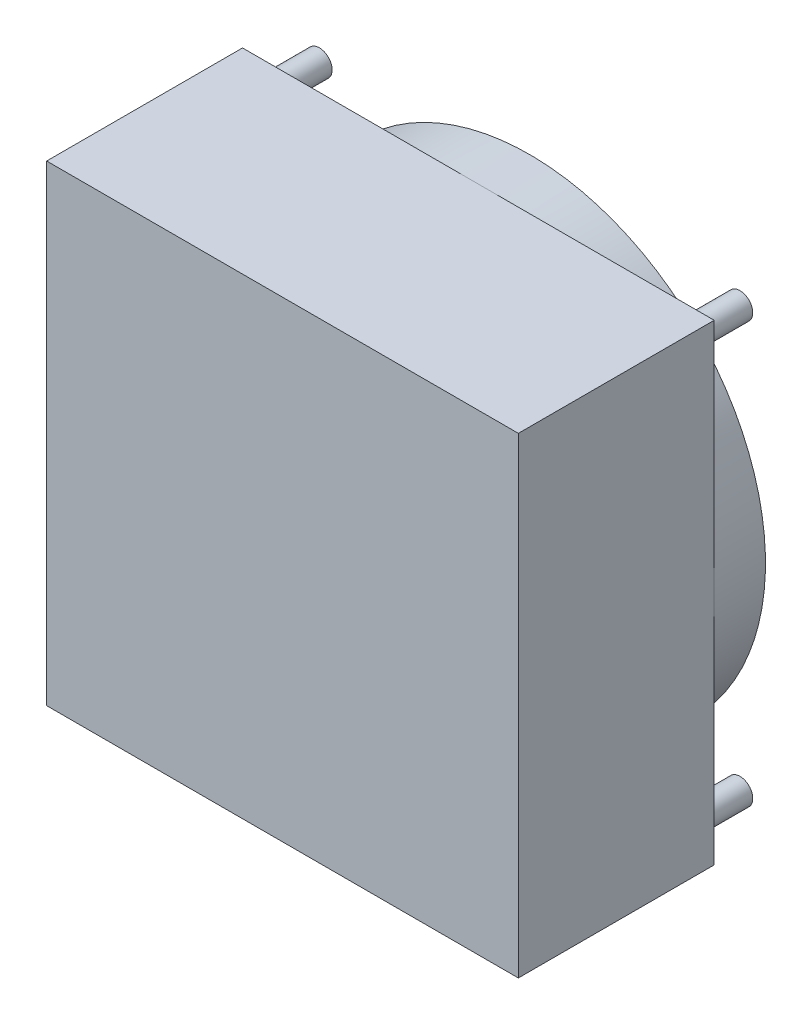
ISO-10303-21;
HEADER;
FILE_DESCRIPTION(('STEP AP214'),'2;1');
FILE_NAME('part.step','',(''),(''),'','','');
FILE_SCHEMA(('AUTOMOTIVE_DESIGN { 1 0 10303 214 1 1 1 1 }'));
ENDSEC;
DATA;
#1=APPLICATION_CONTEXT('core data for automotive mechanical design processes');
#2=APPLICATION_PROTOCOL_DEFINITION('international standard','automotive_design',2000,#1);
#3=PRODUCT_CONTEXT('',#1,'mechanical');
#4=PRODUCT('Part','Part','',(#3));
#5=PRODUCT_RELATED_PRODUCT_CATEGORY('part','',(#4));
#6=PRODUCT_DEFINITION_FORMATION('','',#4);
#7=PRODUCT_DEFINITION_CONTEXT('part definition',#1,'design');
#8=PRODUCT_DEFINITION('design','',#6,#7);
#9=PRODUCT_DEFINITION_SHAPE('','',#8);
#10=(LENGTH_UNIT() NAMED_UNIT(*) SI_UNIT(.MILLI.,.METRE.));
#11=(NAMED_UNIT(*) PLANE_ANGLE_UNIT() SI_UNIT($,.RADIAN.));
#12=(NAMED_UNIT(*) SI_UNIT($,.STERADIAN.) SOLID_ANGLE_UNIT());
#13=UNCERTAINTY_MEASURE_WITH_UNIT(LENGTH_MEASURE(1.E-05),#10,'distance_accuracy_value','');
#14=(GEOMETRIC_REPRESENTATION_CONTEXT(3) GLOBAL_UNCERTAINTY_ASSIGNED_CONTEXT((#13)) GLOBAL_UNIT_ASSIGNED_CONTEXT((#10,
#11,#12)) REPRESENTATION_CONTEXT('',''));
#15=CARTESIAN_POINT('',(0.,0.,0.));
#16=DIRECTION('',(0.,0.,1.));
#17=DIRECTION('',(1.,0.,0.));
#18=AXIS2_PLACEMENT_3D('',#15,#16,#17);
#19=CARTESIAN_POINT('',(0.,92.,0.));
#20=DIRECTION('',(0.,0.,-1.));
#21=DIRECTION('',(-1.,0.,0.));
#22=AXIS2_PLACEMENT_3D('',#19,#20,#21);
#23=PLANE('',#22);
#24=CARTESIAN_POINT('',(4.98,4.98,0.));
#25=DIRECTION('',(0.,0.,-1.));
#26=DIRECTION('',(-1.,0.,0.));
#27=AXIS2_PLACEMENT_3D('',#24,#25,#26);
#28=CIRCLE('',#27,2.5);
#29=CARTESIAN_POINT('',(2.48,4.98,0.));
#30=VERTEX_POINT('',#29);
#31=EDGE_CURVE('E145',#30,#30,#28,.T.);
#32=ORIENTED_EDGE('',*,*,#31,.F.);
#33=EDGE_LOOP('',(#32));
#34=FACE_BOUND('',#33,.T.);
#35=DIRECTION('',(0.,-1.,0.));
#36=VECTOR('',#35,1.);
#37=CARTESIAN_POINT('',(0.,0.,0.));
#38=LINE('',#37,#36);
#39=CARTESIAN_POINT('',(0.,46.,0.));
#40=VERTEX_POINT('',#39);
#41=CARTESIAN_POINT('',(0.,0.,0.));
#42=VERTEX_POINT('',#41);
#43=EDGE_CURVE('E141',#40,#42,#38,.T.);
#44=ORIENTED_EDGE('',*,*,#43,.F.);
#45=CARTESIAN_POINT('',(46.,46.,0.));
#46=DIRECTION('',(0.,0.,-1.));
#47=DIRECTION('',(-1.,0.,0.));
#48=AXIS2_PLACEMENT_3D('',#45,#46,#47);
#49=CIRCLE('',#48,46.);
#50=CARTESIAN_POINT('',(46.,0.,0.));
#51=VERTEX_POINT('',#50);
#52=EDGE_CURVE('E48',#51,#40,#49,.T.);
#53=ORIENTED_EDGE('',*,*,#52,.F.);
#54=DIRECTION('',(1.,0.,0.));
#55=VECTOR('',#54,1.);
#56=CARTESIAN_POINT('',(0.,0.,0.));
#57=LINE('',#56,#55);
#58=EDGE_CURVE('E137',#42,#51,#57,.T.);
#59=ORIENTED_EDGE('',*,*,#58,.F.);
#60=EDGE_LOOP('',(#44,#53,#59));
#61=FACE_BOUND('',#60,.T.);
#62=ADVANCED_FACE('F33',(#34,#61),#23,.T.);
#63=CARTESIAN_POINT('',(87.0200000000002,4.98000000000015,0.));
#64=DIRECTION('',(0.,0.,-1.));
#65=DIRECTION('',(-1.,0.,0.));
#66=AXIS2_PLACEMENT_3D('',#63,#64,#65);
#67=CIRCLE('',#66,2.5);
#68=CARTESIAN_POINT('',(84.5200000000002,4.98000000000015,0.));
#69=VERTEX_POINT('',#68);
#70=EDGE_CURVE('E152',#69,#69,#67,.T.);
#71=ORIENTED_EDGE('',*,*,#70,.F.);
#72=EDGE_LOOP('',(#71));
#73=FACE_BOUND('',#72,.T.);
#74=CARTESIAN_POINT('',(92.,0.,0.));
#75=VERTEX_POINT('',#74);
#76=EDGE_CURVE('E135',#51,#75,#57,.T.);
#77=ORIENTED_EDGE('',*,*,#76,.F.);
#78=CARTESIAN_POINT('',(92.,46.,0.));
#79=VERTEX_POINT('',#78);
#80=EDGE_CURVE('E109',#79,#51,#49,.T.);
#81=ORIENTED_EDGE('',*,*,#80,.F.);
#82=DIRECTION('',(0.,1.,0.));
#83=VECTOR('',#82,1.);
#84=CARTESIAN_POINT('',(92.,0.,0.));
#85=LINE('',#84,#83);
#86=EDGE_CURVE('E113',#75,#79,#85,.T.);
#87=ORIENTED_EDGE('',*,*,#86,.F.);
#88=EDGE_LOOP('',(#77,#81,#87));
#89=FACE_BOUND('',#88,.T.);
#90=ADVANCED_FACE('F134',(#73,#89),#23,.T.);
#91=CARTESIAN_POINT('',(87.0199999999997,87.0200000000003,0.));
#92=DIRECTION('',(0.,0.,-1.));
#93=DIRECTION('',(-1.,0.,0.));
#94=AXIS2_PLACEMENT_3D('',#91,#92,#93);
#95=CIRCLE('',#94,2.5);
#96=CARTESIAN_POINT('',(84.5199999999997,87.0200000000003,0.));
#97=VERTEX_POINT('',#96);
#98=EDGE_CURVE('E158',#97,#97,#95,.T.);
#99=ORIENTED_EDGE('',*,*,#98,.F.);
#100=EDGE_LOOP('',(#99));
#101=FACE_BOUND('',#100,.T.);
#102=CARTESIAN_POINT('',(92.,92.,0.));
#103=VERTEX_POINT('',#102);
#104=EDGE_CURVE('E107',#79,#103,#85,.T.);
#105=ORIENTED_EDGE('',*,*,#104,.F.);
#106=CARTESIAN_POINT('',(46.,92.,0.));
#107=VERTEX_POINT('',#106);
#108=EDGE_CURVE('E95',#107,#79,#49,.T.);
#109=ORIENTED_EDGE('',*,*,#108,.F.);
#110=DIRECTION('',(-1.,0.,0.));
#111=VECTOR('',#110,1.);
#112=CARTESIAN_POINT('',(0.,92.,0.));
#113=LINE('',#112,#111);
#114=EDGE_CURVE('E106',#103,#107,#113,.T.);
#115=ORIENTED_EDGE('',*,*,#114,.F.);
#116=EDGE_LOOP('',(#105,#109,#115));
#117=FACE_BOUND('',#116,.T.);
#118=ADVANCED_FACE('F105',(#101,#117),#23,.T.);
#119=CARTESIAN_POINT('',(4.97999999999957,87.0199999999996,0.));
#120=DIRECTION('',(0.,0.,-1.));
#121=DIRECTION('',(-1.,0.,0.));
#122=AXIS2_PLACEMENT_3D('',#119,#120,#121);
#123=CIRCLE('',#122,2.5);
#124=CARTESIAN_POINT('',(2.47999999999956,87.0199999999996,0.));
#125=VERTEX_POINT('',#124);
#126=EDGE_CURVE('E164',#125,#125,#123,.T.);
#127=ORIENTED_EDGE('',*,*,#126,.F.);
#128=EDGE_LOOP('',(#127));
#129=FACE_BOUND('',#128,.T.);
#130=CARTESIAN_POINT('',(0.,92.,0.));
#131=VERTEX_POINT('',#130);
#132=EDGE_CURVE('E78',#107,#131,#113,.T.);
#133=ORIENTED_EDGE('',*,*,#132,.F.);
#134=EDGE_CURVE('E92',#40,#107,#49,.T.);
#135=ORIENTED_EDGE('',*,*,#134,.F.);
#136=EDGE_CURVE('E112',#131,#40,#38,.T.);
#137=ORIENTED_EDGE('',*,*,#136,.F.);
#138=EDGE_LOOP('',(#133,#135,#137));
#139=FACE_BOUND('',#138,.T.);
#140=ADVANCED_FACE('F110',(#129,#139),#23,.T.);
#141=CARTESIAN_POINT('',(0.,0.,38.2));
#142=DIRECTION('',(1.,0.,0.));
#143=DIRECTION('',(0.,0.,-1.));
#144=AXIS2_PLACEMENT_3D('',#141,#142,#143);
#145=PLANE('',#144);
#146=ORIENTED_EDGE('',*,*,#136,.T.);
#147=ORIENTED_EDGE('',*,*,#43,.T.);
#148=DIRECTION('',(0.,0.,-1.));
#149=VECTOR('',#148,1.);
#150=CARTESIAN_POINT('',(0.,0.,38.2));
#151=LINE('',#150,#149);
#152=CARTESIAN_POINT('',(0.,0.,38.2));
#153=VERTEX_POINT('',#152);
#154=EDGE_CURVE('E11',#153,#42,#151,.T.);
#155=ORIENTED_EDGE('',*,*,#154,.F.);
#156=DIRECTION('',(0.,-1.,0.));
#157=VECTOR('',#156,1.);
#158=CARTESIAN_POINT('',(0.,0.,38.2));
#159=LINE('',#158,#157);
#160=CARTESIAN_POINT('',(0.,92.,38.2));
#161=VERTEX_POINT('',#160);
#162=EDGE_CURVE('E119',#161,#153,#159,.T.);
#163=ORIENTED_EDGE('',*,*,#162,.F.);
#164=DIRECTION('',(0.,0.,-1.));
#165=VECTOR('',#164,1.);
#166=CARTESIAN_POINT('',(0.,92.,38.2));
#167=LINE('',#166,#165);
#168=EDGE_CURVE('E124',#161,#131,#167,.T.);
#169=ORIENTED_EDGE('',*,*,#168,.T.);
#170=EDGE_LOOP('',(#146,#147,#155,#163,#169));
#171=FACE_BOUND('',#170,.T.);
#172=ADVANCED_FACE('F35',(#171),#145,.F.);
#173=CARTESIAN_POINT('',(0.,0.,38.2));
#174=DIRECTION('',(0.,1.,0.));
#175=DIRECTION('',(0.,0.,1.));
#176=AXIS2_PLACEMENT_3D('',#173,#174,#175);
#177=PLANE('',#176);
#178=ORIENTED_EDGE('',*,*,#58,.T.);
#179=ORIENTED_EDGE('',*,*,#76,.T.);
#180=DIRECTION('',(0.,0.,-1.));
#181=VECTOR('',#180,1.);
#182=CARTESIAN_POINT('',(92.,0.,38.2));
#183=LINE('',#182,#181);
#184=CARTESIAN_POINT('',(92.,0.,38.2));
#185=VERTEX_POINT('',#184);
#186=EDGE_CURVE('E41',#185,#75,#183,.T.);
#187=ORIENTED_EDGE('',*,*,#186,.F.);
#188=DIRECTION('',(1.,0.,0.));
#189=VECTOR('',#188,1.);
#190=CARTESIAN_POINT('',(0.,0.,38.2));
#191=LINE('',#190,#189);
#192=EDGE_CURVE('E85',#153,#185,#191,.T.);
#193=ORIENTED_EDGE('',*,*,#192,.F.);
#194=ORIENTED_EDGE('',*,*,#154,.T.);
#195=EDGE_LOOP('',(#178,#179,#187,#193,#194));
#196=FACE_BOUND('',#195,.T.);
#197=ADVANCED_FACE('F202',(#196),#177,.F.);
#198=CARTESIAN_POINT('',(92.,0.,38.2));
#199=DIRECTION('',(-1.,0.,0.));
#200=DIRECTION('',(0.,0.,1.));
#201=AXIS2_PLACEMENT_3D('',#198,#199,#200);
#202=PLANE('',#201);
#203=ORIENTED_EDGE('',*,*,#86,.T.);
#204=ORIENTED_EDGE('',*,*,#104,.T.);
#205=DIRECTION('',(0.,0.,-1.));
#206=VECTOR('',#205,1.);
#207=CARTESIAN_POINT('',(92.,92.,38.2));
#208=LINE('',#207,#206);
#209=CARTESIAN_POINT('',(92.,92.,38.2));
#210=VERTEX_POINT('',#209);
#211=EDGE_CURVE('E118',#210,#103,#208,.T.);
#212=ORIENTED_EDGE('',*,*,#211,.F.);
#213=DIRECTION('',(0.,1.,0.));
#214=VECTOR('',#213,1.);
#215=CARTESIAN_POINT('',(92.,0.,38.2));
#216=LINE('',#215,#214);
#217=EDGE_CURVE('E131',#185,#210,#216,.T.);
#218=ORIENTED_EDGE('',*,*,#217,.F.);
#219=ORIENTED_EDGE('',*,*,#186,.T.);
#220=EDGE_LOOP('',(#203,#204,#212,#218,#219));
#221=FACE_BOUND('',#220,.T.);
#222=ADVANCED_FACE('F130',(#221),#202,.F.);
#223=CARTESIAN_POINT('',(0.,92.,38.2));
#224=DIRECTION('',(0.,-1.,0.));
#225=DIRECTION('',(0.,0.,-1.));
#226=AXIS2_PLACEMENT_3D('',#223,#224,#225);
#227=PLANE('',#226);
#228=ORIENTED_EDGE('',*,*,#114,.T.);
#229=ORIENTED_EDGE('',*,*,#132,.T.);
#230=ORIENTED_EDGE('',*,*,#168,.F.);
#231=DIRECTION('',(-1.,0.,0.));
#232=VECTOR('',#231,1.);
#233=CARTESIAN_POINT('',(0.,92.,38.2));
#234=LINE('',#233,#232);
#235=EDGE_CURVE('E57',#210,#161,#234,.T.);
#236=ORIENTED_EDGE('',*,*,#235,.F.);
#237=ORIENTED_EDGE('',*,*,#211,.T.);
#238=EDGE_LOOP('',(#228,#229,#230,#236,#237));
#239=FACE_BOUND('',#238,.T.);
#240=ADVANCED_FACE('F116',(#239),#227,.F.);
#241=CARTESIAN_POINT('',(0.,92.,38.2));
#242=DIRECTION('',(0.,0.,-1.));
#243=DIRECTION('',(-1.,0.,0.));
#244=AXIS2_PLACEMENT_3D('',#241,#242,#243);
#245=PLANE('',#244);
#246=ORIENTED_EDGE('',*,*,#162,.T.);
#247=ORIENTED_EDGE('',*,*,#192,.T.);
#248=ORIENTED_EDGE('',*,*,#217,.T.);
#249=ORIENTED_EDGE('',*,*,#235,.T.);
#250=EDGE_LOOP('',(#246,#247,#248,#249));
#251=FACE_BOUND('',#250,.T.);
#252=ADVANCED_FACE('F236',(#251),#245,.F.);
#253=CARTESIAN_POINT('',(4.98,4.98,-10.));
#254=DIRECTION('',(0.,0.,1.));
#255=DIRECTION('',(1.,0.,0.));
#256=AXIS2_PLACEMENT_3D('',#253,#254,#255);
#257=CYLINDRICAL_SURFACE('',#256,2.5);
#258=CARTESIAN_POINT('',(4.98,4.98,-10.));
#259=DIRECTION('',(0.,0.,-1.));
#260=DIRECTION('',(-1.,0.,0.));
#261=AXIS2_PLACEMENT_3D('',#258,#259,#260);
#262=CIRCLE('',#261,2.5);
#263=CARTESIAN_POINT('',(2.48,4.98,-10.));
#264=VERTEX_POINT('',#263);
#265=EDGE_CURVE('E148',#264,#264,#262,.T.);
#266=ORIENTED_EDGE('',*,*,#265,.F.);
#267=EDGE_LOOP('',(#266));
#268=FACE_BOUND('',#267,.T.);
#269=ORIENTED_EDGE('',*,*,#31,.T.);
#270=EDGE_LOOP('',(#269));
#271=FACE_BOUND('',#270,.T.);
#272=ADVANCED_FACE('F233',(#268,#271),#257,.T.);
#273=CARTESIAN_POINT('',(4.98,4.98,-10.));
#274=DIRECTION('',(0.,0.,-1.));
#275=DIRECTION('',(-1.,0.,0.));
#276=AXIS2_PLACEMENT_3D('',#273,#274,#275);
#277=PLANE('',#276);
#278=ORIENTED_EDGE('',*,*,#265,.T.);
#279=EDGE_LOOP('',(#278));
#280=FACE_BOUND('',#279,.T.);
#281=ADVANCED_FACE('F229',(#280),#277,.T.);
#282=CARTESIAN_POINT('',(87.0200000000002,4.98000000000015,-10.));
#283=DIRECTION('',(0.,0.,1.));
#284=DIRECTION('',(1.,0.,0.));
#285=AXIS2_PLACEMENT_3D('',#282,#283,#284);
#286=CYLINDRICAL_SURFACE('',#285,2.5);
#287=CARTESIAN_POINT('',(87.0200000000002,4.98000000000015,-10.));
#288=DIRECTION('',(0.,0.,-1.));
#289=DIRECTION('',(-1.,0.,0.));
#290=AXIS2_PLACEMENT_3D('',#287,#288,#289);
#291=CIRCLE('',#290,2.5);
#292=CARTESIAN_POINT('',(84.5200000000002,4.98000000000015,-10.));
#293=VERTEX_POINT('',#292);
#294=EDGE_CURVE('E149',#293,#293,#291,.T.);
#295=ORIENTED_EDGE('',*,*,#294,.F.);
#296=EDGE_LOOP('',(#295));
#297=FACE_BOUND('',#296,.T.);
#298=ORIENTED_EDGE('',*,*,#70,.T.);
#299=EDGE_LOOP('',(#298));
#300=FACE_BOUND('',#299,.T.);
#301=ADVANCED_FACE('F225',(#297,#300),#286,.T.);
#302=CARTESIAN_POINT('',(87.0200000000002,4.98000000000015,-10.));
#303=DIRECTION('',(0.,0.,-1.));
#304=DIRECTION('',(-1.,0.,0.));
#305=AXIS2_PLACEMENT_3D('',#302,#303,#304);
#306=PLANE('',#305);
#307=ORIENTED_EDGE('',*,*,#294,.T.);
#308=EDGE_LOOP('',(#307));
#309=FACE_BOUND('',#308,.T.);
#310=ADVANCED_FACE('F221',(#309),#306,.T.);
#311=CARTESIAN_POINT('',(87.0199999999997,87.0200000000003,-10.));
#312=DIRECTION('',(0.,0.,1.));
#313=DIRECTION('',(1.,0.,0.));
#314=AXIS2_PLACEMENT_3D('',#311,#312,#313);
#315=CYLINDRICAL_SURFACE('',#314,2.5);
#316=CARTESIAN_POINT('',(87.0199999999997,87.0200000000003,-10.));
#317=DIRECTION('',(0.,0.,-1.));
#318=DIRECTION('',(-1.,0.,0.));
#319=AXIS2_PLACEMENT_3D('',#316,#317,#318);
#320=CIRCLE('',#319,2.5);
#321=CARTESIAN_POINT('',(84.5199999999997,87.0200000000003,-10.));
#322=VERTEX_POINT('',#321);
#323=EDGE_CURVE('E155',#322,#322,#320,.T.);
#324=ORIENTED_EDGE('',*,*,#323,.F.);
#325=EDGE_LOOP('',(#324));
#326=FACE_BOUND('',#325,.T.);
#327=ORIENTED_EDGE('',*,*,#98,.T.);
#328=EDGE_LOOP('',(#327));
#329=FACE_BOUND('',#328,.T.);
#330=ADVANCED_FACE('F214',(#326,#329),#315,.T.);
#331=CARTESIAN_POINT('',(87.0199999999997,87.0200000000003,-10.));
#332=DIRECTION('',(0.,0.,-1.));
#333=DIRECTION('',(-1.,0.,0.));
#334=AXIS2_PLACEMENT_3D('',#331,#332,#333);
#335=PLANE('',#334);
#336=ORIENTED_EDGE('',*,*,#323,.T.);
#337=EDGE_LOOP('',(#336));
#338=FACE_BOUND('',#337,.T.);
#339=ADVANCED_FACE('F208',(#338),#335,.T.);
#340=CARTESIAN_POINT('',(4.97999999999957,87.0199999999996,-10.));
#341=DIRECTION('',(0.,0.,1.));
#342=DIRECTION('',(1.,0.,0.));
#343=AXIS2_PLACEMENT_3D('',#340,#341,#342);
#344=CYLINDRICAL_SURFACE('',#343,2.5);
#345=CARTESIAN_POINT('',(4.97999999999957,87.0199999999996,-10.));
#346=DIRECTION('',(0.,0.,-1.));
#347=DIRECTION('',(-1.,0.,0.));
#348=AXIS2_PLACEMENT_3D('',#345,#346,#347);
#349=CIRCLE('',#348,2.5);
#350=CARTESIAN_POINT('',(2.47999999999956,87.0199999999996,-10.));
#351=VERTEX_POINT('',#350);
#352=EDGE_CURVE('E161',#351,#351,#349,.T.);
#353=ORIENTED_EDGE('',*,*,#352,.F.);
#354=EDGE_LOOP('',(#353));
#355=FACE_BOUND('',#354,.T.);
#356=ORIENTED_EDGE('',*,*,#126,.T.);
#357=EDGE_LOOP('',(#356));
#358=FACE_BOUND('',#357,.T.);
#359=ADVANCED_FACE('F182',(#355,#358),#344,.T.);
#360=CARTESIAN_POINT('',(4.97999999999957,87.0199999999996,-10.));
#361=DIRECTION('',(0.,0.,-1.));
#362=DIRECTION('',(-1.,0.,0.));
#363=AXIS2_PLACEMENT_3D('',#360,#361,#362);
#364=PLANE('',#363);
#365=ORIENTED_EDGE('',*,*,#352,.T.);
#366=EDGE_LOOP('',(#365));
#367=FACE_BOUND('',#366,.T.);
#368=ADVANCED_FACE('F175',(#367),#364,.T.);
#369=CARTESIAN_POINT('',(46.,46.,-10.));
#370=DIRECTION('',(0.,0.,1.));
#371=DIRECTION('',(1.,0.,0.));
#372=AXIS2_PLACEMENT_3D('',#369,#370,#371);
#373=CYLINDRICAL_SURFACE('',#372,46.);
#374=CARTESIAN_POINT('',(46.,46.,-10.));
#375=DIRECTION('',(0.,0.,-1.));
#376=DIRECTION('',(-1.,0.,0.));
#377=AXIS2_PLACEMENT_3D('',#374,#375,#376);
#378=CIRCLE('',#377,46.);
#379=CARTESIAN_POINT('',(0.,46.,-10.));
#380=VERTEX_POINT('',#379);
#381=EDGE_CURVE('E100',#380,#380,#378,.T.);
#382=ORIENTED_EDGE('',*,*,#381,.F.);
#383=EDGE_LOOP('',(#382));
#384=FACE_BOUND('',#383,.T.);
#385=ORIENTED_EDGE('',*,*,#134,.T.);
#386=ORIENTED_EDGE('',*,*,#108,.T.);
#387=ORIENTED_EDGE('',*,*,#80,.T.);
#388=ORIENTED_EDGE('',*,*,#52,.T.);
#389=EDGE_LOOP('',(#385,#386,#387,#388));
#390=FACE_BOUND('',#389,.T.);
#391=ADVANCED_FACE('F94',(#384,#390),#373,.T.);
#392=CARTESIAN_POINT('',(46.,46.,-10.));
#393=DIRECTION('',(0.,0.,-1.));
#394=DIRECTION('',(-1.,0.,0.));
#395=AXIS2_PLACEMENT_3D('',#392,#393,#394);
#396=PLANE('',#395);
#397=ORIENTED_EDGE('',*,*,#381,.T.);
#398=EDGE_LOOP('',(#397));
#399=FACE_BOUND('',#398,.T.);
#400=ADVANCED_FACE('F172',(#399),#396,.T.);
#401=CLOSED_SHELL('',(#62,#90,#118,#140,#172,#197,#222,#240,#252,#272,#281,#301,#310,#330,#339,
#359,#368,#391,#400));
#402=MANIFOLD_SOLID_BREP('B2',#401);
#403=ADVANCED_BREP_SHAPE_REPRESENTATION('',(#18,#402),#14);
#404=SHAPE_DEFINITION_REPRESENTATION(#9,#403);
ENDSEC;
END-ISO-10303-21;
